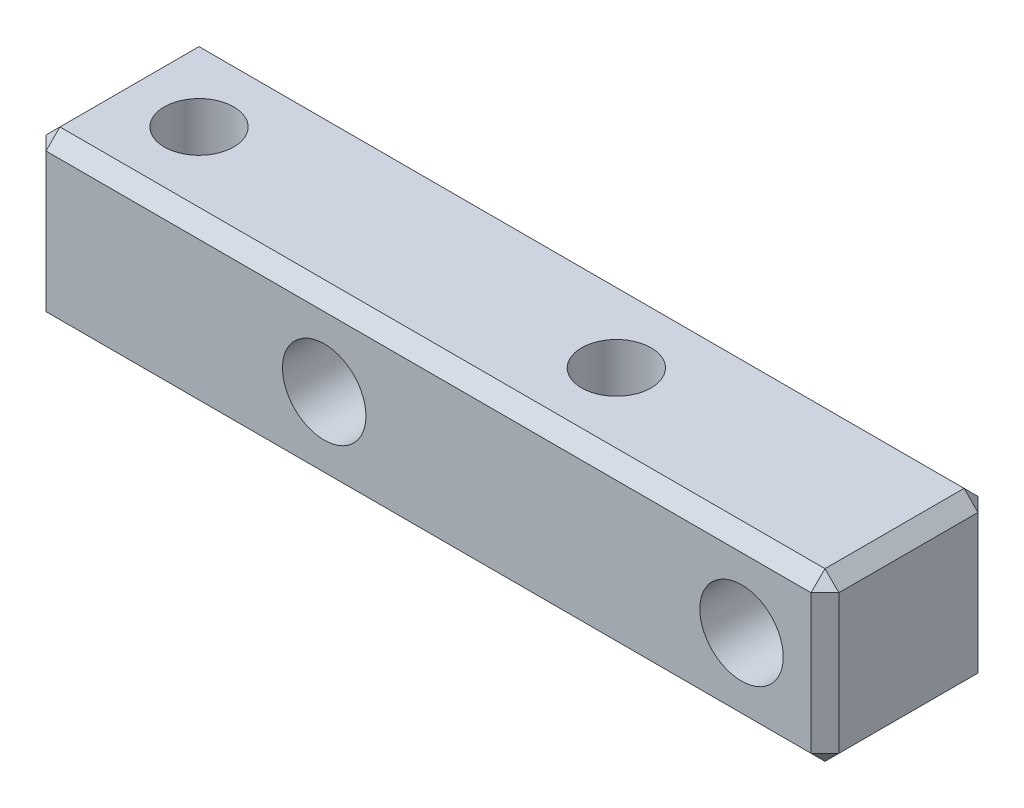
ISO-10303-21;
HEADER;
FILE_DESCRIPTION(('STEP AP214'),'2;1');
FILE_NAME('part.step','',(''),(''),'','','');
FILE_SCHEMA(('AUTOMOTIVE_DESIGN { 1 0 10303 214 1 1 1 1 }'));
ENDSEC;
DATA;
#1=APPLICATION_CONTEXT('core data for automotive mechanical design processes');
#2=APPLICATION_PROTOCOL_DEFINITION('international standard','automotive_design',2000,#1);
#3=PRODUCT_CONTEXT('',#1,'mechanical');
#4=PRODUCT('Part','Part','',(#3));
#5=PRODUCT_RELATED_PRODUCT_CATEGORY('part','',(#4));
#6=PRODUCT_DEFINITION_FORMATION('','',#4);
#7=PRODUCT_DEFINITION_CONTEXT('part definition',#1,'design');
#8=PRODUCT_DEFINITION('design','',#6,#7);
#9=PRODUCT_DEFINITION_SHAPE('','',#8);
#10=(LENGTH_UNIT() NAMED_UNIT(*) SI_UNIT(.MILLI.,.METRE.));
#11=(NAMED_UNIT(*) PLANE_ANGLE_UNIT() SI_UNIT($,.RADIAN.));
#12=(NAMED_UNIT(*) SI_UNIT($,.STERADIAN.) SOLID_ANGLE_UNIT());
#13=UNCERTAINTY_MEASURE_WITH_UNIT(LENGTH_MEASURE(1.E-05),#10,'distance_accuracy_value','');
#14=(GEOMETRIC_REPRESENTATION_CONTEXT(3) GLOBAL_UNCERTAINTY_ASSIGNED_CONTEXT((#13)) GLOBAL_UNIT_ASSIGNED_CONTEXT((#10,
#11,#12)) REPRESENTATION_CONTEXT('',''));
#15=CARTESIAN_POINT('',(0.,0.,0.));
#16=DIRECTION('',(0.,0.,1.));
#17=DIRECTION('',(1.,0.,0.));
#18=AXIS2_PLACEMENT_3D('',#15,#16,#17);
#19=CARTESIAN_POINT('',(0.,0.,3.));
#20=DIRECTION('',(0.,0.,-1.));
#21=DIRECTION('',(-1.,0.,0.));
#22=AXIS2_PLACEMENT_3D('',#19,#20,#21);
#23=PLANE('',#22);
#24=DIRECTION('',(-1.,0.,0.));
#25=VECTOR('',#24,1.);
#26=CARTESIAN_POINT('',(0.,2.5,3.));
#27=LINE('',#26,#25);
#28=CARTESIAN_POINT('',(2.5,2.5,3.));
#29=VERTEX_POINT('',#28);
#30=CARTESIAN_POINT('',(-25.,2.5,3.));
#31=VERTEX_POINT('',#30);
#32=EDGE_CURVE('E174',#29,#31,#27,.T.);
#33=ORIENTED_EDGE('',*,*,#32,.T.);
#34=DIRECTION('',(0.,-1.,0.));
#35=VECTOR('',#34,1.);
#36=CARTESIAN_POINT('',(-25.,0.,3.));
#37=LINE('',#36,#35);
#38=CARTESIAN_POINT('',(-25.,-2.5,3.));
#39=VERTEX_POINT('',#38);
#40=EDGE_CURVE('E180',#31,#39,#37,.T.);
#41=ORIENTED_EDGE('',*,*,#40,.T.);
#42=DIRECTION('',(1.,0.,0.));
#43=VECTOR('',#42,1.);
#44=CARTESIAN_POINT('',(0.,-2.5,3.));
#45=LINE('',#44,#43);
#46=CARTESIAN_POINT('',(2.5,-2.5,3.));
#47=VERTEX_POINT('',#46);
#48=EDGE_CURVE('E178',#39,#47,#45,.T.);
#49=ORIENTED_EDGE('',*,*,#48,.T.);
#50=DIRECTION('',(0.,1.,0.));
#51=VECTOR('',#50,1.);
#52=CARTESIAN_POINT('',(2.5,0.,3.));
#53=LINE('',#52,#51);
#54=EDGE_CURVE('E176',#47,#29,#53,.T.);
#55=ORIENTED_EDGE('',*,*,#54,.T.);
#56=EDGE_LOOP('',(#33,#41,#49,#55));
#57=FACE_BOUND('',#56,.T.);
#58=CARTESIAN_POINT('',(0.,0.,3.));
#59=DIRECTION('',(0.,0.,1.));
#60=DIRECTION('',(1.,0.,0.));
#61=AXIS2_PLACEMENT_3D('',#58,#59,#60);
#62=CIRCLE('',#61,1.5);
#63=CARTESIAN_POINT('',(1.5,0.,3.));
#64=VERTEX_POINT('',#63);
#65=EDGE_CURVE('E157',#64,#64,#62,.T.);
#66=ORIENTED_EDGE('',*,*,#65,.F.);
#67=EDGE_LOOP('',(#66));
#68=FACE_BOUND('',#67,.T.);
#69=CARTESIAN_POINT('',(-15.,0.,3.));
#70=DIRECTION('',(0.,0.,1.));
#71=DIRECTION('',(1.,0.,0.));
#72=AXIS2_PLACEMENT_3D('',#69,#70,#71);
#73=CIRCLE('',#72,1.5);
#74=CARTESIAN_POINT('',(-13.5,0.,3.));
#75=VERTEX_POINT('',#74);
#76=EDGE_CURVE('E280',#75,#75,#73,.T.);
#77=ORIENTED_EDGE('',*,*,#76,.F.);
#78=EDGE_LOOP('',(#77));
#79=FACE_BOUND('',#78,.T.);
#80=ADVANCED_FACE('F36',(#57,#68,#79),#23,.F.);
#81=CARTESIAN_POINT('',(0.,0.,-3.));
#82=DIRECTION('',(0.,0.,-1.));
#83=DIRECTION('',(-1.,0.,0.));
#84=AXIS2_PLACEMENT_3D('',#81,#82,#83);
#85=PLANE('',#84);
#86=DIRECTION('',(-1.,0.,0.));
#87=VECTOR('',#86,1.);
#88=CARTESIAN_POINT('',(-25.5,-2.5,-3.));
#89=LINE('',#88,#87);
#90=CARTESIAN_POINT('',(2.5,-2.5,-3.));
#91=VERTEX_POINT('',#90);
#92=CARTESIAN_POINT('',(-25.,-2.5,-3.));
#93=VERTEX_POINT('',#92);
#94=EDGE_CURVE('E196',#91,#93,#89,.T.);
#95=ORIENTED_EDGE('',*,*,#94,.T.);
#96=DIRECTION('',(0.,1.,0.));
#97=VECTOR('',#96,1.);
#98=CARTESIAN_POINT('',(-25.,3.,-3.));
#99=LINE('',#98,#97);
#100=CARTESIAN_POINT('',(-25.,2.5,-3.));
#101=VERTEX_POINT('',#100);
#102=EDGE_CURVE('E198',#93,#101,#99,.T.);
#103=ORIENTED_EDGE('',*,*,#102,.T.);
#104=DIRECTION('',(1.,0.,0.));
#105=VECTOR('',#104,1.);
#106=CARTESIAN_POINT('',(3.,2.5,-3.));
#107=LINE('',#106,#105);
#108=CARTESIAN_POINT('',(2.5,2.5,-3.));
#109=VERTEX_POINT('',#108);
#110=EDGE_CURVE('E192',#101,#109,#107,.T.);
#111=ORIENTED_EDGE('',*,*,#110,.T.);
#112=DIRECTION('',(0.,-1.,0.));
#113=VECTOR('',#112,1.);
#114=CARTESIAN_POINT('',(2.5,-3.,-3.));
#115=LINE('',#114,#113);
#116=EDGE_CURVE('E194',#109,#91,#115,.T.);
#117=ORIENTED_EDGE('',*,*,#116,.T.);
#118=EDGE_LOOP('',(#95,#103,#111,#117));
#119=FACE_BOUND('',#118,.T.);
#120=CARTESIAN_POINT('',(0.,0.,-3.));
#121=DIRECTION('',(0.,0.,1.));
#122=DIRECTION('',(1.,0.,0.));
#123=AXIS2_PLACEMENT_3D('',#120,#121,#122);
#124=CIRCLE('',#123,1.5);
#125=CARTESIAN_POINT('',(1.5,0.,-3.));
#126=VERTEX_POINT('',#125);
#127=EDGE_CURVE('E283',#126,#126,#124,.T.);
#128=ORIENTED_EDGE('',*,*,#127,.T.);
#129=EDGE_LOOP('',(#128));
#130=FACE_BOUND('',#129,.T.);
#131=CARTESIAN_POINT('',(-15.,0.,-3.));
#132=DIRECTION('',(0.,0.,1.));
#133=DIRECTION('',(1.,0.,0.));
#134=AXIS2_PLACEMENT_3D('',#131,#132,#133);
#135=CIRCLE('',#134,1.5);
#136=CARTESIAN_POINT('',(-13.5,0.,-3.));
#137=VERTEX_POINT('',#136);
#138=EDGE_CURVE('E279',#137,#137,#135,.T.);
#139=ORIENTED_EDGE('',*,*,#138,.T.);
#140=EDGE_LOOP('',(#139));
#141=FACE_BOUND('',#140,.T.);
#142=ADVANCED_FACE('F322',(#119,#130,#141),#85,.T.);
#143=CARTESIAN_POINT('',(-25.5,3.,3.));
#144=DIRECTION('',(0.,-1.,0.));
#145=DIRECTION('',(0.,0.,-1.));
#146=AXIS2_PLACEMENT_3D('',#143,#144,#145);
#147=PLANE('',#146);
#148=DIRECTION('',(-1.,0.,0.));
#149=VECTOR('',#148,1.);
#150=CARTESIAN_POINT('',(-25.5,3.,-2.5));
#151=LINE('',#150,#149);
#152=CARTESIAN_POINT('',(2.5,3.,-2.5));
#153=VERTEX_POINT('',#152);
#154=CARTESIAN_POINT('',(-25.,3.,-2.5));
#155=VERTEX_POINT('',#154);
#156=EDGE_CURVE('E171',#153,#155,#151,.T.);
#157=ORIENTED_EDGE('',*,*,#156,.T.);
#158=DIRECTION('',(0.,0.,1.));
#159=VECTOR('',#158,1.);
#160=CARTESIAN_POINT('',(-25.,3.,3.));
#161=LINE('',#160,#159);
#162=CARTESIAN_POINT('',(-25.,3.,2.5));
#163=VERTEX_POINT('',#162);
#164=EDGE_CURVE('E134',#155,#163,#161,.T.);
#165=ORIENTED_EDGE('',*,*,#164,.T.);
#166=DIRECTION('',(1.,0.,0.));
#167=VECTOR('',#166,1.);
#168=CARTESIAN_POINT('',(-25.5,3.,2.5));
#169=LINE('',#168,#167);
#170=CARTESIAN_POINT('',(2.5,3.,2.5));
#171=VERTEX_POINT('',#170);
#172=EDGE_CURVE('E163',#163,#171,#169,.T.);
#173=ORIENTED_EDGE('',*,*,#172,.T.);
#174=DIRECTION('',(0.,0.,-1.));
#175=VECTOR('',#174,1.);
#176=CARTESIAN_POINT('',(2.5,3.,3.));
#177=LINE('',#176,#175);
#178=EDGE_CURVE('E165',#171,#153,#177,.T.);
#179=ORIENTED_EDGE('',*,*,#178,.T.);
#180=EDGE_LOOP('',(#157,#165,#173,#179));
#181=FACE_BOUND('',#180,.T.);
#182=CARTESIAN_POINT('',(-7.5,3.,0.));
#183=DIRECTION('',(0.,1.,0.));
#184=DIRECTION('',(0.,0.,1.));
#185=AXIS2_PLACEMENT_3D('',#182,#183,#184);
#186=CIRCLE('',#185,1.25);
#187=CARTESIAN_POINT('',(-7.5,3.,1.25));
#188=VERTEX_POINT('',#187);
#189=EDGE_CURVE('E260',#188,#188,#186,.T.);
#190=ORIENTED_EDGE('',*,*,#189,.F.);
#191=EDGE_LOOP('',(#190));
#192=FACE_BOUND('',#191,.T.);
#193=CARTESIAN_POINT('',(-22.5,3.,0.));
#194=DIRECTION('',(0.,1.,0.));
#195=DIRECTION('',(0.,0.,1.));
#196=AXIS2_PLACEMENT_3D('',#193,#194,#195);
#197=CIRCLE('',#196,1.25);
#198=CARTESIAN_POINT('',(-22.5,3.,1.25));
#199=VERTEX_POINT('',#198);
#200=EDGE_CURVE('E271',#199,#199,#197,.T.);
#201=ORIENTED_EDGE('',*,*,#200,.F.);
#202=EDGE_LOOP('',(#201));
#203=FACE_BOUND('',#202,.T.);
#204=ADVANCED_FACE('F313',(#181,#192,#203),#147,.F.);
#205=CARTESIAN_POINT('',(-25.5,3.,3.));
#206=DIRECTION('',(1.,0.,0.));
#207=DIRECTION('',(0.,0.,-1.));
#208=AXIS2_PLACEMENT_3D('',#205,#206,#207);
#209=PLANE('',#208);
#210=DIRECTION('',(0.,1.,0.));
#211=VECTOR('',#210,1.);
#212=CARTESIAN_POINT('',(-25.5,3.,2.5));
#213=LINE('',#212,#211);
#214=CARTESIAN_POINT('',(-25.5,-2.5,2.5));
#215=VERTEX_POINT('',#214);
#216=CARTESIAN_POINT('',(-25.5,2.5,2.5));
#217=VERTEX_POINT('',#216);
#218=EDGE_CURVE('E161',#215,#217,#213,.T.);
#219=ORIENTED_EDGE('',*,*,#218,.T.);
#220=DIRECTION('',(0.,0.,-1.));
#221=VECTOR('',#220,1.);
#222=CARTESIAN_POINT('',(-25.5,2.5,3.));
#223=LINE('',#222,#221);
#224=CARTESIAN_POINT('',(-25.5,2.5,-2.5));
#225=VERTEX_POINT('',#224);
#226=EDGE_CURVE('E132',#217,#225,#223,.T.);
#227=ORIENTED_EDGE('',*,*,#226,.T.);
#228=DIRECTION('',(0.,-1.,0.));
#229=VECTOR('',#228,1.);
#230=CARTESIAN_POINT('',(-25.5,-3.,-2.5));
#231=LINE('',#230,#229);
#232=CARTESIAN_POINT('',(-25.5,-2.5,-2.5));
#233=VERTEX_POINT('',#232);
#234=EDGE_CURVE('E150',#225,#233,#231,.T.);
#235=ORIENTED_EDGE('',*,*,#234,.T.);
#236=DIRECTION('',(0.,0.,1.));
#237=VECTOR('',#236,1.);
#238=CARTESIAN_POINT('',(-25.5,-2.5,3.));
#239=LINE('',#238,#237);
#240=EDGE_CURVE('E156',#233,#215,#239,.T.);
#241=ORIENTED_EDGE('',*,*,#240,.T.);
#242=EDGE_LOOP('',(#219,#227,#235,#241));
#243=FACE_BOUND('',#242,.T.);
#244=ADVANCED_FACE('F159',(#243),#209,.F.);
#245=CARTESIAN_POINT('',(3.,-3.,3.));
#246=DIRECTION('',(0.,1.,0.));
#247=DIRECTION('',(-1.,0.,0.));
#248=AXIS2_PLACEMENT_3D('',#245,#246,#247);
#249=PLANE('',#248);
#250=DIRECTION('',(0.,0.,1.));
#251=VECTOR('',#250,1.);
#252=CARTESIAN_POINT('',(2.5,-3.,3.));
#253=LINE('',#252,#251);
#254=CARTESIAN_POINT('',(2.5,-3.,-2.5));
#255=VERTEX_POINT('',#254);
#256=CARTESIAN_POINT('',(2.5,-3.,2.5));
#257=VERTEX_POINT('',#256);
#258=EDGE_CURVE('E185',#255,#257,#253,.T.);
#259=ORIENTED_EDGE('',*,*,#258,.T.);
#260=DIRECTION('',(-1.,0.,0.));
#261=VECTOR('',#260,1.);
#262=CARTESIAN_POINT('',(3.,-3.,2.5));
#263=LINE('',#262,#261);
#264=CARTESIAN_POINT('',(-25.,-3.,2.5));
#265=VERTEX_POINT('',#264);
#266=EDGE_CURVE('E190',#257,#265,#263,.T.);
#267=ORIENTED_EDGE('',*,*,#266,.T.);
#268=DIRECTION('',(0.,0.,-1.));
#269=VECTOR('',#268,1.);
#270=CARTESIAN_POINT('',(-25.,-3.,3.));
#271=LINE('',#270,#269);
#272=CARTESIAN_POINT('',(-25.,-3.,-2.5));
#273=VERTEX_POINT('',#272);
#274=EDGE_CURVE('E187',#265,#273,#271,.T.);
#275=ORIENTED_EDGE('',*,*,#274,.T.);
#276=DIRECTION('',(1.,0.,0.));
#277=VECTOR('',#276,1.);
#278=CARTESIAN_POINT('',(3.,-3.,-2.5));
#279=LINE('',#278,#277);
#280=EDGE_CURVE('E183',#273,#255,#279,.T.);
#281=ORIENTED_EDGE('',*,*,#280,.T.);
#282=EDGE_LOOP('',(#259,#267,#275,#281));
#283=FACE_BOUND('',#282,.T.);
#284=CARTESIAN_POINT('',(-7.5,-3.,0.));
#285=DIRECTION('',(0.,1.,0.));
#286=DIRECTION('',(0.,0.,1.));
#287=AXIS2_PLACEMENT_3D('',#284,#285,#286);
#288=CIRCLE('',#287,1.25);
#289=CARTESIAN_POINT('',(-7.5,-3.,1.25));
#290=VERTEX_POINT('',#289);
#291=EDGE_CURVE('E266',#290,#290,#288,.T.);
#292=ORIENTED_EDGE('',*,*,#291,.T.);
#293=EDGE_LOOP('',(#292));
#294=FACE_BOUND('',#293,.T.);
#295=CARTESIAN_POINT('',(-22.5,-3.,0.));
#296=DIRECTION('',(0.,1.,0.));
#297=DIRECTION('',(0.,0.,1.));
#298=AXIS2_PLACEMENT_3D('',#295,#296,#297);
#299=CIRCLE('',#298,1.25);
#300=CARTESIAN_POINT('',(-22.5,-3.,1.25));
#301=VERTEX_POINT('',#300);
#302=EDGE_CURVE('E276',#301,#301,#299,.T.);
#303=ORIENTED_EDGE('',*,*,#302,.T.);
#304=EDGE_LOOP('',(#303));
#305=FACE_BOUND('',#304,.T.);
#306=ADVANCED_FACE('F357',(#283,#294,#305),#249,.F.);
#307=CARTESIAN_POINT('',(3.,3.,3.));
#308=DIRECTION('',(-1.,0.,0.));
#309=DIRECTION('',(0.,-1.,0.));
#310=AXIS2_PLACEMENT_3D('',#307,#308,#309);
#311=PLANE('',#310);
#312=DIRECTION('',(0.,-1.,0.));
#313=VECTOR('',#312,1.);
#314=CARTESIAN_POINT('',(3.,3.,2.5));
#315=LINE('',#314,#313);
#316=CARTESIAN_POINT('',(3.,2.5,2.5));
#317=VERTEX_POINT('',#316);
#318=CARTESIAN_POINT('',(3.,-2.5,2.5));
#319=VERTEX_POINT('',#318);
#320=EDGE_CURVE('E45',#317,#319,#315,.T.);
#321=ORIENTED_EDGE('',*,*,#320,.T.);
#322=DIRECTION('',(0.,0.,-1.));
#323=VECTOR('',#322,1.);
#324=CARTESIAN_POINT('',(3.,-2.5,3.));
#325=LINE('',#324,#323);
#326=CARTESIAN_POINT('',(3.,-2.5,-2.5));
#327=VERTEX_POINT('',#326);
#328=EDGE_CURVE('E11',#319,#327,#325,.T.);
#329=ORIENTED_EDGE('',*,*,#328,.T.);
#330=DIRECTION('',(0.,1.,0.));
#331=VECTOR('',#330,1.);
#332=CARTESIAN_POINT('',(3.,3.,-2.5));
#333=LINE('',#332,#331);
#334=CARTESIAN_POINT('',(3.,2.5,-2.5));
#335=VERTEX_POINT('',#334);
#336=EDGE_CURVE('E59',#327,#335,#333,.T.);
#337=ORIENTED_EDGE('',*,*,#336,.T.);
#338=DIRECTION('',(0.,0.,1.));
#339=VECTOR('',#338,1.);
#340=CARTESIAN_POINT('',(3.,2.5,3.));
#341=LINE('',#340,#339);
#342=EDGE_CURVE('E201',#335,#317,#341,.T.);
#343=ORIENTED_EDGE('',*,*,#342,.T.);
#344=EDGE_LOOP('',(#321,#329,#337,#343));
#345=FACE_BOUND('',#344,.T.);
#346=ADVANCED_FACE('F354',(#345),#311,.F.);
#347=CARTESIAN_POINT('',(0.,0.,3.));
#348=DIRECTION('',(0.,0.,-1.));
#349=DIRECTION('',(-1.,0.,0.));
#350=AXIS2_PLACEMENT_3D('',#347,#348,#349);
#351=CYLINDRICAL_SURFACE('',#350,1.5);
#352=ORIENTED_EDGE('',*,*,#65,.T.);
#353=EDGE_LOOP('',(#352));
#354=FACE_BOUND('',#353,.T.);
#355=ORIENTED_EDGE('',*,*,#127,.F.);
#356=EDGE_LOOP('',(#355));
#357=FACE_BOUND('',#356,.T.);
#358=ADVANCED_FACE('F351',(#354,#357),#351,.F.);
#359=CARTESIAN_POINT('',(-15.,0.,3.));
#360=DIRECTION('',(0.,0.,-1.));
#361=DIRECTION('',(-1.,0.,0.));
#362=AXIS2_PLACEMENT_3D('',#359,#360,#361);
#363=CYLINDRICAL_SURFACE('',#362,1.5);
#364=ORIENTED_EDGE('',*,*,#76,.T.);
#365=EDGE_LOOP('',(#364));
#366=FACE_BOUND('',#365,.T.);
#367=ORIENTED_EDGE('',*,*,#138,.F.);
#368=EDGE_LOOP('',(#367));
#369=FACE_BOUND('',#368,.T.);
#370=ADVANCED_FACE('F532',(#366,#369),#363,.F.);
#371=CARTESIAN_POINT('',(-22.5,3.,0.));
#372=DIRECTION('',(0.,1.,0.));
#373=DIRECTION('',(0.,0.,1.));
#374=AXIS2_PLACEMENT_3D('',#371,#372,#373);
#375=CYLINDRICAL_SURFACE('',#374,1.25);
#376=ORIENTED_EDGE('',*,*,#302,.F.);
#377=EDGE_LOOP('',(#376));
#378=FACE_BOUND('',#377,.T.);
#379=ORIENTED_EDGE('',*,*,#200,.T.);
#380=EDGE_LOOP('',(#379));
#381=FACE_BOUND('',#380,.T.);
#382=ADVANCED_FACE('F522',(#378,#381),#375,.F.);
#383=CARTESIAN_POINT('',(-7.5,3.,0.));
#384=DIRECTION('',(0.,1.,0.));
#385=DIRECTION('',(0.,0.,1.));
#386=AXIS2_PLACEMENT_3D('',#383,#384,#385);
#387=CYLINDRICAL_SURFACE('',#386,1.25);
#388=ORIENTED_EDGE('',*,*,#291,.F.);
#389=EDGE_LOOP('',(#388));
#390=FACE_BOUND('',#389,.T.);
#391=ORIENTED_EDGE('',*,*,#189,.T.);
#392=EDGE_LOOP('',(#391));
#393=FACE_BOUND('',#392,.T.);
#394=ADVANCED_FACE('F513',(#390,#393),#387,.F.);
#395=CARTESIAN_POINT('',(3.,-2.5,3.));
#396=DIRECTION('',(-0.707106781186547,0.707106781186547,0.));
#397=DIRECTION('',(0.,0.,-1.));
#398=AXIS2_PLACEMENT_3D('',#395,#396,#397);
#399=PLANE('',#398);
#400=DIRECTION('',(-0.707106781186547,-0.707106781186547,0.));
#401=VECTOR('',#400,1.);
#402=CARTESIAN_POINT('',(2.5,-3.,2.5));
#403=LINE('',#402,#401);
#404=EDGE_CURVE('E40',#257,#319,#403,.F.);
#405=ORIENTED_EDGE('',*,*,#404,.F.);
#406=ORIENTED_EDGE('',*,*,#258,.F.);
#407=DIRECTION('',(0.707106781186548,0.707106781186548,0.));
#408=VECTOR('',#407,1.);
#409=CARTESIAN_POINT('',(3.,-2.5,-2.5));
#410=LINE('',#409,#408);
#411=EDGE_CURVE('E254',#327,#255,#410,.F.);
#412=ORIENTED_EDGE('',*,*,#411,.F.);
#413=ORIENTED_EDGE('',*,*,#328,.F.);
#414=EDGE_LOOP('',(#405,#406,#412,#413));
#415=FACE_BOUND('',#414,.T.);
#416=ADVANCED_FACE('F38',(#415),#399,.F.);
#417=CARTESIAN_POINT('',(2.5,-3.,2.5));
#418=DIRECTION('',(0.577350269189626,-0.577350269189626,0.577350269189626));
#419=DIRECTION('',(0.707106781186547,0.,-0.707106781186547));
#420=AXIS2_PLACEMENT_3D('',#417,#418,#419);
#421=PLANE('',#420);
#422=DIRECTION('',(0.,0.707106781186547,0.707106781186548));
#423=VECTOR('',#422,1.);
#424=CARTESIAN_POINT('',(2.5,-3.,2.5));
#425=LINE('',#424,#423);
#426=EDGE_CURVE('E249',#257,#47,#425,.T.);
#427=ORIENTED_EDGE('',*,*,#426,.F.);
#428=ORIENTED_EDGE('',*,*,#404,.T.);
#429=DIRECTION('',(0.707106781186548,0.,-0.707106781186547));
#430=VECTOR('',#429,1.);
#431=CARTESIAN_POINT('',(2.75,-2.5,2.75));
#432=LINE('',#431,#430);
#433=EDGE_CURVE('E252',#47,#319,#432,.T.);
#434=ORIENTED_EDGE('',*,*,#433,.F.);
#435=EDGE_LOOP('',(#427,#428,#434));
#436=FACE_BOUND('',#435,.T.);
#437=ADVANCED_FACE('F499',(#436),#421,.T.);
#438=CARTESIAN_POINT('',(3.,-2.5,-2.5));
#439=DIRECTION('',(0.577350269189626,-0.577350269189626,-0.577350269189626));
#440=DIRECTION('',(-0.707106781186548,0.,-0.707106781186547));
#441=AXIS2_PLACEMENT_3D('',#438,#439,#440);
#442=PLANE('',#441);
#443=DIRECTION('',(0.707106781186548,0.,0.707106781186547));
#444=VECTOR('',#443,1.);
#445=CARTESIAN_POINT('',(3.,-2.5,-2.5));
#446=LINE('',#445,#444);
#447=EDGE_CURVE('E244',#327,#91,#446,.F.);
#448=ORIENTED_EDGE('',*,*,#447,.F.);
#449=ORIENTED_EDGE('',*,*,#411,.T.);
#450=DIRECTION('',(0.,0.707106781186547,-0.707106781186548));
#451=VECTOR('',#450,1.);
#452=CARTESIAN_POINT('',(2.5,-2.75,-2.75));
#453=LINE('',#452,#451);
#454=EDGE_CURVE('E246',#91,#255,#453,.F.);
#455=ORIENTED_EDGE('',*,*,#454,.F.);
#456=EDGE_LOOP('',(#448,#449,#455));
#457=FACE_BOUND('',#456,.T.);
#458=ADVANCED_FACE('F490',(#457),#442,.T.);
#459=CARTESIAN_POINT('',(2.5,0.,3.));
#460=DIRECTION('',(-0.707106781186547,0.,-0.707106781186548));
#461=DIRECTION('',(0.,1.,0.));
#462=AXIS2_PLACEMENT_3D('',#459,#460,#461);
#463=PLANE('',#462);
#464=ORIENTED_EDGE('',*,*,#433,.T.);
#465=ORIENTED_EDGE('',*,*,#320,.F.);
#466=DIRECTION('',(-0.707106781186548,0.,0.707106781186547));
#467=VECTOR('',#466,1.);
#468=CARTESIAN_POINT('',(2.5,2.5,3.));
#469=LINE('',#468,#467);
#470=EDGE_CURVE('E238',#29,#317,#469,.F.);
#471=ORIENTED_EDGE('',*,*,#470,.F.);
#472=ORIENTED_EDGE('',*,*,#54,.F.);
#473=EDGE_LOOP('',(#464,#465,#471,#472));
#474=FACE_BOUND('',#473,.T.);
#475=ADVANCED_FACE('F481',(#474),#463,.F.);
#476=CARTESIAN_POINT('',(0.,-2.5,3.));
#477=DIRECTION('',(0.,0.707106781186548,-0.707106781186547));
#478=DIRECTION('',(1.,0.,0.));
#479=AXIS2_PLACEMENT_3D('',#476,#477,#478);
#480=PLANE('',#479);
#481=ORIENTED_EDGE('',*,*,#426,.T.);
#482=ORIENTED_EDGE('',*,*,#48,.F.);
#483=DIRECTION('',(0.,-0.707106781186547,-0.707106781186547));
#484=VECTOR('',#483,1.);
#485=CARTESIAN_POINT('',(-25.,-2.5,3.));
#486=LINE('',#485,#484);
#487=EDGE_CURVE('E235',#265,#39,#486,.F.);
#488=ORIENTED_EDGE('',*,*,#487,.F.);
#489=ORIENTED_EDGE('',*,*,#266,.F.);
#490=EDGE_LOOP('',(#481,#482,#488,#489));
#491=FACE_BOUND('',#490,.T.);
#492=ADVANCED_FACE('F473',(#491),#480,.F.);
#493=CARTESIAN_POINT('',(-25.,-3.,3.));
#494=DIRECTION('',(0.707106781186547,0.707106781186547,0.));
#495=DIRECTION('',(0.,0.,-1.));
#496=AXIS2_PLACEMENT_3D('',#493,#494,#495);
#497=PLANE('',#496);
#498=DIRECTION('',(0.707106781186547,-0.707106781186547,0.));
#499=VECTOR('',#498,1.);
#500=CARTESIAN_POINT('',(-25.,-3.,-2.5));
#501=LINE('',#500,#499);
#502=EDGE_CURVE('E229',#273,#233,#501,.F.);
#503=ORIENTED_EDGE('',*,*,#502,.F.);
#504=ORIENTED_EDGE('',*,*,#274,.F.);
#505=DIRECTION('',(-0.707106781186547,0.707106781186547,0.));
#506=VECTOR('',#505,1.);
#507=CARTESIAN_POINT('',(-25.25,-2.75,2.5));
#508=LINE('',#507,#506);
#509=EDGE_CURVE('E232',#215,#265,#508,.F.);
#510=ORIENTED_EDGE('',*,*,#509,.F.);
#511=ORIENTED_EDGE('',*,*,#240,.F.);
#512=EDGE_LOOP('',(#503,#504,#510,#511));
#513=FACE_BOUND('',#512,.T.);
#514=ADVANCED_FACE('F294',(#513),#497,.F.);
#515=CARTESIAN_POINT('',(3.,-3.,-2.5));
#516=DIRECTION('',(0.,-0.707106781186548,-0.707106781186547));
#517=DIRECTION('',(-1.,0.,0.));
#518=AXIS2_PLACEMENT_3D('',#515,#516,#517);
#519=PLANE('',#518);
#520=ORIENTED_EDGE('',*,*,#454,.T.);
#521=ORIENTED_EDGE('',*,*,#280,.F.);
#522=DIRECTION('',(0.,-0.707106781186547,0.707106781186547));
#523=VECTOR('',#522,1.);
#524=CARTESIAN_POINT('',(-25.,-3.,-2.5));
#525=LINE('',#524,#523);
#526=EDGE_CURVE('E227',#93,#273,#525,.T.);
#527=ORIENTED_EDGE('',*,*,#526,.F.);
#528=ORIENTED_EDGE('',*,*,#94,.F.);
#529=EDGE_LOOP('',(#520,#521,#527,#528));
#530=FACE_BOUND('',#529,.T.);
#531=ADVANCED_FACE('F328',(#530),#519,.T.);
#532=CARTESIAN_POINT('',(3.,3.,-2.5));
#533=DIRECTION('',(0.707106781186547,0.,-0.707106781186548));
#534=DIRECTION('',(0.,-1.,0.));
#535=AXIS2_PLACEMENT_3D('',#532,#533,#534);
#536=PLANE('',#535);
#537=ORIENTED_EDGE('',*,*,#447,.T.);
#538=ORIENTED_EDGE('',*,*,#116,.F.);
#539=DIRECTION('',(-0.707106781186548,0.,-0.707106781186547));
#540=VECTOR('',#539,1.);
#541=CARTESIAN_POINT('',(3.,2.5,-2.5));
#542=LINE('',#541,#540);
#543=EDGE_CURVE('E224',#335,#109,#542,.T.);
#544=ORIENTED_EDGE('',*,*,#543,.F.);
#545=ORIENTED_EDGE('',*,*,#336,.F.);
#546=EDGE_LOOP('',(#537,#538,#544,#545));
#547=FACE_BOUND('',#546,.T.);
#548=ADVANCED_FACE('F450',(#547),#536,.T.);
#549=CARTESIAN_POINT('',(2.5,3.,3.));
#550=DIRECTION('',(-0.707106781186547,-0.707106781186547,0.));
#551=DIRECTION('',(0.,0.,-1.));
#552=AXIS2_PLACEMENT_3D('',#549,#550,#551);
#553=PLANE('',#552);
#554=DIRECTION('',(0.707106781186547,-0.707106781186547,0.));
#555=VECTOR('',#554,1.);
#556=CARTESIAN_POINT('',(2.75,2.75,2.5));
#557=LINE('',#556,#555);
#558=EDGE_CURVE('E241',#317,#171,#557,.F.);
#559=ORIENTED_EDGE('',*,*,#558,.F.);
#560=ORIENTED_EDGE('',*,*,#342,.F.);
#561=DIRECTION('',(-0.707106781186548,0.707106781186548,0.));
#562=VECTOR('',#561,1.);
#563=CARTESIAN_POINT('',(3.,2.5,-2.5));
#564=LINE('',#563,#562);
#565=EDGE_CURVE('E221',#153,#335,#564,.F.);
#566=ORIENTED_EDGE('',*,*,#565,.F.);
#567=ORIENTED_EDGE('',*,*,#178,.F.);
#568=EDGE_LOOP('',(#559,#560,#566,#567));
#569=FACE_BOUND('',#568,.T.);
#570=ADVANCED_FACE('F441',(#569),#553,.F.);
#571=CARTESIAN_POINT('',(2.5,2.5,3.));
#572=DIRECTION('',(0.577350269189626,0.577350269189626,0.577350269189626));
#573=DIRECTION('',(0.707106781186547,0.,-0.707106781186547));
#574=AXIS2_PLACEMENT_3D('',#571,#572,#573);
#575=PLANE('',#574);
#576=ORIENTED_EDGE('',*,*,#470,.T.);
#577=ORIENTED_EDGE('',*,*,#558,.T.);
#578=DIRECTION('',(0.,0.707106781186547,-0.707106781186547));
#579=VECTOR('',#578,1.);
#580=CARTESIAN_POINT('',(2.5,2.5,3.));
#581=LINE('',#580,#579);
#582=EDGE_CURVE('E218',#29,#171,#581,.T.);
#583=ORIENTED_EDGE('',*,*,#582,.F.);
#584=EDGE_LOOP('',(#576,#577,#583));
#585=FACE_BOUND('',#584,.T.);
#586=ADVANCED_FACE('F340',(#585),#575,.T.);
#587=CARTESIAN_POINT('',(-25.,-2.5,3.));
#588=DIRECTION('',(-0.577350269189626,-0.577350269189626,0.577350269189626));
#589=DIRECTION('',(0.707106781186547,0.,0.707106781186547));
#590=AXIS2_PLACEMENT_3D('',#587,#588,#589);
#591=PLANE('',#590);
#592=ORIENTED_EDGE('',*,*,#509,.T.);
#593=ORIENTED_EDGE('',*,*,#487,.T.);
#594=DIRECTION('',(0.707106781186547,0.,0.707106781186547));
#595=VECTOR('',#594,1.);
#596=CARTESIAN_POINT('',(-25.,-2.5,3.));
#597=LINE('',#596,#595);
#598=EDGE_CURVE('E216',#215,#39,#597,.T.);
#599=ORIENTED_EDGE('',*,*,#598,.F.);
#600=EDGE_LOOP('',(#592,#593,#599));
#601=FACE_BOUND('',#600,.T.);
#602=ADVANCED_FACE('F297',(#601),#591,.T.);
#603=CARTESIAN_POINT('',(-25.,-3.,-2.5));
#604=DIRECTION('',(-0.577350269189626,-0.577350269189626,-0.577350269189626));
#605=DIRECTION('',(-0.707106781186547,0.,0.707106781186547));
#606=AXIS2_PLACEMENT_3D('',#603,#604,#605);
#607=PLANE('',#606);
#608=ORIENTED_EDGE('',*,*,#526,.T.);
#609=ORIENTED_EDGE('',*,*,#502,.T.);
#610=DIRECTION('',(0.707106781186547,0.,-0.707106781186547));
#611=VECTOR('',#610,1.);
#612=CARTESIAN_POINT('',(-25.25,-2.5,-2.75));
#613=LINE('',#612,#611);
#614=EDGE_CURVE('E153',#93,#233,#613,.F.);
#615=ORIENTED_EDGE('',*,*,#614,.F.);
#616=EDGE_LOOP('',(#608,#609,#615));
#617=FACE_BOUND('',#616,.T.);
#618=ADVANCED_FACE('F330',(#617),#607,.T.);
#619=CARTESIAN_POINT('',(3.,2.5,-2.5));
#620=DIRECTION('',(0.577350269189626,0.577350269189626,-0.577350269189626));
#621=DIRECTION('',(-0.707106781186548,0.,-0.707106781186547));
#622=AXIS2_PLACEMENT_3D('',#619,#620,#621);
#623=PLANE('',#622);
#624=ORIENTED_EDGE('',*,*,#565,.T.);
#625=ORIENTED_EDGE('',*,*,#543,.T.);
#626=DIRECTION('',(0.,0.707106781186547,0.707106781186547));
#627=VECTOR('',#626,1.);
#628=CARTESIAN_POINT('',(2.5,2.75,-2.75));
#629=LINE('',#628,#627);
#630=EDGE_CURVE('E212',#153,#109,#629,.F.);
#631=ORIENTED_EDGE('',*,*,#630,.F.);
#632=EDGE_LOOP('',(#624,#625,#631));
#633=FACE_BOUND('',#632,.T.);
#634=ADVANCED_FACE('F332',(#633),#623,.T.);
#635=CARTESIAN_POINT('',(0.,2.5,3.));
#636=DIRECTION('',(0.,-0.707106781186547,-0.707106781186547));
#637=DIRECTION('',(-1.,0.,0.));
#638=AXIS2_PLACEMENT_3D('',#635,#636,#637);
#639=PLANE('',#638);
#640=ORIENTED_EDGE('',*,*,#582,.T.);
#641=ORIENTED_EDGE('',*,*,#172,.F.);
#642=DIRECTION('',(0.,-0.707106781186547,0.707106781186547));
#643=VECTOR('',#642,1.);
#644=CARTESIAN_POINT('',(-25.,3.,2.5));
#645=LINE('',#644,#643);
#646=EDGE_CURVE('E209',#31,#163,#645,.F.);
#647=ORIENTED_EDGE('',*,*,#646,.F.);
#648=ORIENTED_EDGE('',*,*,#32,.F.);
#649=EDGE_LOOP('',(#640,#641,#647,#648));
#650=FACE_BOUND('',#649,.T.);
#651=ADVANCED_FACE('F309',(#650),#639,.F.);
#652=CARTESIAN_POINT('',(-25.,0.,3.));
#653=DIRECTION('',(0.707106781186547,0.,-0.707106781186547));
#654=DIRECTION('',(0.,-1.,0.));
#655=AXIS2_PLACEMENT_3D('',#652,#653,#654);
#656=PLANE('',#655);
#657=ORIENTED_EDGE('',*,*,#598,.T.);
#658=ORIENTED_EDGE('',*,*,#40,.F.);
#659=DIRECTION('',(-0.707106781186547,0.,-0.707106781186547));
#660=VECTOR('',#659,1.);
#661=CARTESIAN_POINT('',(-25.25,2.5,2.75));
#662=LINE('',#661,#660);
#663=EDGE_CURVE('E147',#217,#31,#662,.F.);
#664=ORIENTED_EDGE('',*,*,#663,.F.);
#665=ORIENTED_EDGE('',*,*,#218,.F.);
#666=EDGE_LOOP('',(#657,#658,#664,#665));
#667=FACE_BOUND('',#666,.T.);
#668=ADVANCED_FACE('F301',(#667),#656,.F.);
#669=CARTESIAN_POINT('',(-25.5,3.,-2.5));
#670=DIRECTION('',(-0.707106781186547,0.,-0.707106781186547));
#671=DIRECTION('',(0.,1.,0.));
#672=AXIS2_PLACEMENT_3D('',#669,#670,#671);
#673=PLANE('',#672);
#674=ORIENTED_EDGE('',*,*,#614,.T.);
#675=ORIENTED_EDGE('',*,*,#234,.F.);
#676=DIRECTION('',(-0.707106781186547,0.,0.707106781186547));
#677=VECTOR('',#676,1.);
#678=CARTESIAN_POINT('',(-25.5,2.5,-2.5));
#679=LINE('',#678,#677);
#680=EDGE_CURVE('E139',#101,#225,#679,.T.);
#681=ORIENTED_EDGE('',*,*,#680,.F.);
#682=ORIENTED_EDGE('',*,*,#102,.F.);
#683=EDGE_LOOP('',(#674,#675,#681,#682));
#684=FACE_BOUND('',#683,.T.);
#685=ADVANCED_FACE('F151',(#684),#673,.T.);
#686=CARTESIAN_POINT('',(-25.5,3.,-2.5));
#687=DIRECTION('',(0.,0.707106781186547,-0.707106781186547));
#688=DIRECTION('',(1.,0.,0.));
#689=AXIS2_PLACEMENT_3D('',#686,#687,#688);
#690=PLANE('',#689);
#691=ORIENTED_EDGE('',*,*,#630,.T.);
#692=ORIENTED_EDGE('',*,*,#110,.F.);
#693=DIRECTION('',(0.,-0.707106781186547,-0.707106781186547));
#694=VECTOR('',#693,1.);
#695=CARTESIAN_POINT('',(-25.,2.75,-2.75));
#696=LINE('',#695,#694);
#697=EDGE_CURVE('E143',#155,#101,#696,.T.);
#698=ORIENTED_EDGE('',*,*,#697,.F.);
#699=ORIENTED_EDGE('',*,*,#156,.F.);
#700=EDGE_LOOP('',(#691,#692,#698,#699));
#701=FACE_BOUND('',#700,.T.);
#702=ADVANCED_FACE('F318',(#701),#690,.T.);
#703=CARTESIAN_POINT('',(-25.,3.,2.5));
#704=DIRECTION('',(-0.577350269189626,0.577350269189626,0.577350269189626));
#705=DIRECTION('',(0.707106781186547,0.,0.707106781186547));
#706=AXIS2_PLACEMENT_3D('',#703,#704,#705);
#707=PLANE('',#706);
#708=ORIENTED_EDGE('',*,*,#663,.T.);
#709=ORIENTED_EDGE('',*,*,#646,.T.);
#710=DIRECTION('',(0.707106781186547,0.707106781186547,0.));
#711=VECTOR('',#710,1.);
#712=CARTESIAN_POINT('',(-25.,3.,2.5));
#713=LINE('',#712,#711);
#714=EDGE_CURVE('E136',#217,#163,#713,.T.);
#715=ORIENTED_EDGE('',*,*,#714,.F.);
#716=EDGE_LOOP('',(#708,#709,#715));
#717=FACE_BOUND('',#716,.T.);
#718=ADVANCED_FACE('F305',(#717),#707,.T.);
#719=CARTESIAN_POINT('',(-25.5,2.5,-2.5));
#720=DIRECTION('',(-0.577350269189626,0.577350269189626,-0.577350269189626));
#721=DIRECTION('',(-0.707106781186547,0.,0.707106781186547));
#722=AXIS2_PLACEMENT_3D('',#719,#720,#721);
#723=PLANE('',#722);
#724=ORIENTED_EDGE('',*,*,#697,.T.);
#725=ORIENTED_EDGE('',*,*,#680,.T.);
#726=DIRECTION('',(-0.707106781186547,-0.707106781186547,0.));
#727=VECTOR('',#726,1.);
#728=CARTESIAN_POINT('',(-25.5,2.5,-2.5));
#729=LINE('',#728,#727);
#730=EDGE_CURVE('E128',#155,#225,#729,.T.);
#731=ORIENTED_EDGE('',*,*,#730,.F.);
#732=EDGE_LOOP('',(#724,#725,#731));
#733=FACE_BOUND('',#732,.T.);
#734=ADVANCED_FACE('F141',(#733),#723,.T.);
#735=CARTESIAN_POINT('',(-25.5,2.5,3.));
#736=DIRECTION('',(0.707106781186547,-0.707106781186547,0.));
#737=DIRECTION('',(0.,0.,-1.));
#738=AXIS2_PLACEMENT_3D('',#735,#736,#737);
#739=PLANE('',#738);
#740=ORIENTED_EDGE('',*,*,#714,.T.);
#741=ORIENTED_EDGE('',*,*,#164,.F.);
#742=ORIENTED_EDGE('',*,*,#730,.T.);
#743=ORIENTED_EDGE('',*,*,#226,.F.);
#744=EDGE_LOOP('',(#740,#741,#742,#743));
#745=FACE_BOUND('',#744,.T.);
#746=ADVANCED_FACE('F130',(#745),#739,.F.);
#747=CLOSED_SHELL('',(#80,#142,#204,#244,#306,#346,#358,#370,#382,#394,#416,#437,#458,#475,#492,
#514,#531,#548,#570,#586,#602,#618,#634,#651,#668,#685,#702,#718,#734,#746));
#748=MANIFOLD_SOLID_BREP('B2',#747);
#749=ADVANCED_BREP_SHAPE_REPRESENTATION('',(#18,#748),#14);
#750=SHAPE_DEFINITION_REPRESENTATION(#9,#749);
ENDSEC;
END-ISO-10303-21;
